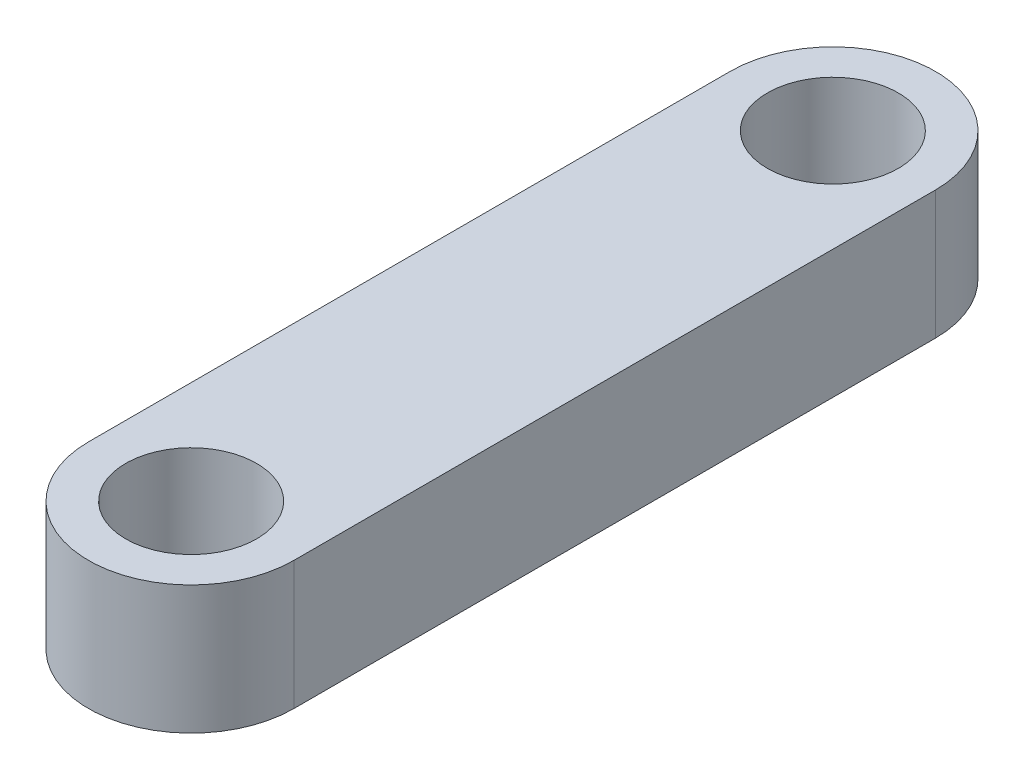
ISO-10303-21;
HEADER;
FILE_DESCRIPTION(('STEP AP214'),'2;1');
FILE_NAME('part.step','',(''),(''),'','','');
FILE_SCHEMA(('AUTOMOTIVE_DESIGN { 1 0 10303 214 1 1 1 1 }'));
ENDSEC;
DATA;
#1=APPLICATION_CONTEXT('core data for automotive mechanical design processes');
#2=APPLICATION_PROTOCOL_DEFINITION('international standard','automotive_design',2000,#1);
#3=PRODUCT_CONTEXT('',#1,'mechanical');
#4=PRODUCT('Part','Part','',(#3));
#5=PRODUCT_RELATED_PRODUCT_CATEGORY('part','',(#4));
#6=PRODUCT_DEFINITION_FORMATION('','',#4);
#7=PRODUCT_DEFINITION_CONTEXT('part definition',#1,'design');
#8=PRODUCT_DEFINITION('design','',#6,#7);
#9=PRODUCT_DEFINITION_SHAPE('','',#8);
#10=(LENGTH_UNIT() NAMED_UNIT(*) SI_UNIT(.MILLI.,.METRE.));
#11=(NAMED_UNIT(*) PLANE_ANGLE_UNIT() SI_UNIT($,.RADIAN.));
#12=(NAMED_UNIT(*) SI_UNIT($,.STERADIAN.) SOLID_ANGLE_UNIT());
#13=UNCERTAINTY_MEASURE_WITH_UNIT(LENGTH_MEASURE(1.E-05),#10,'distance_accuracy_value','');
#14=(GEOMETRIC_REPRESENTATION_CONTEXT(3) GLOBAL_UNCERTAINTY_ASSIGNED_CONTEXT((#13)) GLOBAL_UNIT_ASSIGNED_CONTEXT((#10,
#11,#12)) REPRESENTATION_CONTEXT('',''));
#15=CARTESIAN_POINT('',(0.,0.,0.));
#16=DIRECTION('',(0.,0.,1.));
#17=DIRECTION('',(1.,0.,0.));
#18=AXIS2_PLACEMENT_3D('',#15,#16,#17);
#19=CARTESIAN_POINT('',(0.,5.,-12.5));
#20=DIRECTION('',(0.,-1.,0.));
#21=DIRECTION('',(0.,0.,-1.));
#22=AXIS2_PLACEMENT_3D('',#19,#20,#21);
#23=CYLINDRICAL_SURFACE('',#22,3.99999999999999);
#24=CARTESIAN_POINT('',(0.,0.,-12.5));
#25=DIRECTION('',(0.,1.,0.));
#26=DIRECTION('',(0.,0.,1.));
#27=AXIS2_PLACEMENT_3D('',#24,#25,#26);
#28=CIRCLE('',#27,3.99999999999999);
#29=CARTESIAN_POINT('',(3.99999999999999,0.,-12.5));
#30=VERTEX_POINT('',#29);
#31=CARTESIAN_POINT('',(-3.99999999999999,0.,-12.5));
#32=VERTEX_POINT('',#31);
#33=EDGE_CURVE('E98',#30,#32,#28,.T.);
#34=ORIENTED_EDGE('',*,*,#33,.T.);
#35=DIRECTION('',(0.,-1.,0.));
#36=VECTOR('',#35,1.);
#37=CARTESIAN_POINT('',(-3.99999999999999,5.,-12.5));
#38=LINE('',#37,#36);
#39=CARTESIAN_POINT('',(-3.99999999999999,5.,-12.5));
#40=VERTEX_POINT('',#39);
#41=EDGE_CURVE('E11',#40,#32,#38,.T.);
#42=ORIENTED_EDGE('',*,*,#41,.F.);
#43=CARTESIAN_POINT('',(0.,5.,-12.5));
#44=DIRECTION('',(0.,1.,0.));
#45=DIRECTION('',(0.,0.,1.));
#46=AXIS2_PLACEMENT_3D('',#43,#44,#45);
#47=CIRCLE('',#46,3.99999999999999);
#48=CARTESIAN_POINT('',(3.99999999999999,5.,-12.5));
#49=VERTEX_POINT('',#48);
#50=EDGE_CURVE('E86',#49,#40,#47,.T.);
#51=ORIENTED_EDGE('',*,*,#50,.F.);
#52=DIRECTION('',(0.,-1.,0.));
#53=VECTOR('',#52,1.);
#54=CARTESIAN_POINT('',(3.99999999999999,5.,-12.5));
#55=LINE('',#54,#53);
#56=EDGE_CURVE('E94',#49,#30,#55,.T.);
#57=ORIENTED_EDGE('',*,*,#56,.T.);
#58=EDGE_LOOP('',(#34,#42,#51,#57));
#59=FACE_BOUND('',#58,.T.);
#60=ADVANCED_FACE('F35',(#59),#23,.T.);
#61=CARTESIAN_POINT('',(-3.99999999999999,5.,12.5));
#62=DIRECTION('',(1.,0.,0.));
#63=DIRECTION('',(0.,0.,-1.));
#64=AXIS2_PLACEMENT_3D('',#61,#62,#63);
#65=PLANE('',#64);
#66=DIRECTION('',(0.,0.,1.));
#67=VECTOR('',#66,1.);
#68=CARTESIAN_POINT('',(-3.99999999999999,0.,12.5));
#69=LINE('',#68,#67);
#70=CARTESIAN_POINT('',(-3.99999999999999,0.,12.5));
#71=VERTEX_POINT('',#70);
#72=EDGE_CURVE('E90',#32,#71,#69,.T.);
#73=ORIENTED_EDGE('',*,*,#72,.T.);
#74=DIRECTION('',(0.,-1.,0.));
#75=VECTOR('',#74,1.);
#76=CARTESIAN_POINT('',(-3.99999999999999,5.,12.5));
#77=LINE('',#76,#75);
#78=CARTESIAN_POINT('',(-3.99999999999999,5.,12.5));
#79=VERTEX_POINT('',#78);
#80=EDGE_CURVE('E43',#79,#71,#77,.T.);
#81=ORIENTED_EDGE('',*,*,#80,.F.);
#82=DIRECTION('',(0.,0.,1.));
#83=VECTOR('',#82,1.);
#84=CARTESIAN_POINT('',(-3.99999999999999,5.,12.5));
#85=LINE('',#84,#83);
#86=EDGE_CURVE('E81',#40,#79,#85,.T.);
#87=ORIENTED_EDGE('',*,*,#86,.F.);
#88=ORIENTED_EDGE('',*,*,#41,.T.);
#89=EDGE_LOOP('',(#73,#81,#87,#88));
#90=FACE_BOUND('',#89,.T.);
#91=ADVANCED_FACE('F89',(#90),#65,.F.);
#92=CARTESIAN_POINT('',(0.,5.,12.5));
#93=DIRECTION('',(0.,-1.,0.));
#94=DIRECTION('',(0.,0.,-1.));
#95=AXIS2_PLACEMENT_3D('',#92,#93,#94);
#96=CYLINDRICAL_SURFACE('',#95,3.99999999999999);
#97=CARTESIAN_POINT('',(0.,0.,12.5));
#98=DIRECTION('',(0.,1.,0.));
#99=DIRECTION('',(0.,0.,1.));
#100=AXIS2_PLACEMENT_3D('',#97,#98,#99);
#101=CIRCLE('',#100,3.99999999999999);
#102=CARTESIAN_POINT('',(3.99999999999999,0.,12.5));
#103=VERTEX_POINT('',#102);
#104=EDGE_CURVE('E68',#71,#103,#101,.T.);
#105=ORIENTED_EDGE('',*,*,#104,.T.);
#106=DIRECTION('',(0.,-1.,0.));
#107=VECTOR('',#106,1.);
#108=CARTESIAN_POINT('',(3.99999999999999,5.,12.5));
#109=LINE('',#108,#107);
#110=CARTESIAN_POINT('',(3.99999999999999,5.,12.5));
#111=VERTEX_POINT('',#110);
#112=EDGE_CURVE('E91',#111,#103,#109,.T.);
#113=ORIENTED_EDGE('',*,*,#112,.F.);
#114=CARTESIAN_POINT('',(0.,5.,12.5));
#115=DIRECTION('',(0.,1.,0.));
#116=DIRECTION('',(0.,0.,1.));
#117=AXIS2_PLACEMENT_3D('',#114,#115,#116);
#118=CIRCLE('',#117,3.99999999999999);
#119=EDGE_CURVE('E84',#79,#111,#118,.T.);
#120=ORIENTED_EDGE('',*,*,#119,.F.);
#121=ORIENTED_EDGE('',*,*,#80,.T.);
#122=EDGE_LOOP('',(#105,#113,#120,#121));
#123=FACE_BOUND('',#122,.T.);
#124=ADVANCED_FACE('F92',(#123),#96,.T.);
#125=CARTESIAN_POINT('',(3.99999999999999,5.,12.5));
#126=DIRECTION('',(-1.,0.,0.));
#127=DIRECTION('',(0.,0.,1.));
#128=AXIS2_PLACEMENT_3D('',#125,#126,#127);
#129=PLANE('',#128);
#130=DIRECTION('',(0.,0.,-1.));
#131=VECTOR('',#130,1.);
#132=CARTESIAN_POINT('',(3.99999999999999,0.,12.5));
#133=LINE('',#132,#131);
#134=EDGE_CURVE('E74',#103,#30,#133,.T.);
#135=ORIENTED_EDGE('',*,*,#134,.T.);
#136=ORIENTED_EDGE('',*,*,#56,.F.);
#137=DIRECTION('',(0.,0.,-1.));
#138=VECTOR('',#137,1.);
#139=CARTESIAN_POINT('',(3.99999999999999,5.,12.5));
#140=LINE('',#139,#138);
#141=EDGE_CURVE('E51',#111,#49,#140,.T.);
#142=ORIENTED_EDGE('',*,*,#141,.F.);
#143=ORIENTED_EDGE('',*,*,#112,.T.);
#144=EDGE_LOOP('',(#135,#136,#142,#143));
#145=FACE_BOUND('',#144,.T.);
#146=ADVANCED_FACE('F106',(#145),#129,.F.);
#147=CARTESIAN_POINT('',(0.,5.,-12.5));
#148=DIRECTION('',(0.,1.,0.));
#149=DIRECTION('',(0.,0.,1.));
#150=AXIS2_PLACEMENT_3D('',#147,#148,#149);
#151=PLANE('',#150);
#152=CARTESIAN_POINT('',(0.,5.,-12.5));
#153=DIRECTION('',(0.,1.,0.));
#154=DIRECTION('',(0.,0.,1.));
#155=AXIS2_PLACEMENT_3D('',#152,#153,#154);
#156=CIRCLE('',#155,2.55);
#157=CARTESIAN_POINT('',(0.,5.,-9.95));
#158=VERTEX_POINT('',#157);
#159=EDGE_CURVE('E118',#158,#158,#156,.T.);
#160=ORIENTED_EDGE('',*,*,#159,.F.);
#161=EDGE_LOOP('',(#160));
#162=FACE_BOUND('',#161,.T.);
#163=CARTESIAN_POINT('',(0.,5.,12.5));
#164=DIRECTION('',(0.,1.,0.));
#165=DIRECTION('',(0.,0.,1.));
#166=AXIS2_PLACEMENT_3D('',#163,#164,#165);
#167=CIRCLE('',#166,2.55);
#168=CARTESIAN_POINT('',(0.,5.,15.05));
#169=VERTEX_POINT('',#168);
#170=EDGE_CURVE('E112',#169,#169,#167,.T.);
#171=ORIENTED_EDGE('',*,*,#170,.F.);
#172=EDGE_LOOP('',(#171));
#173=FACE_BOUND('',#172,.T.);
#174=ORIENTED_EDGE('',*,*,#50,.T.);
#175=ORIENTED_EDGE('',*,*,#86,.T.);
#176=ORIENTED_EDGE('',*,*,#119,.T.);
#177=ORIENTED_EDGE('',*,*,#141,.T.);
#178=EDGE_LOOP('',(#174,#175,#176,#177));
#179=FACE_BOUND('',#178,.T.);
#180=ADVANCED_FACE('F82',(#162,#173,#179),#151,.T.);
#181=CARTESIAN_POINT('',(0.,0.,-12.5));
#182=DIRECTION('',(0.,1.,0.));
#183=DIRECTION('',(0.,0.,1.));
#184=AXIS2_PLACEMENT_3D('',#181,#182,#183);
#185=PLANE('',#184);
#186=CARTESIAN_POINT('',(0.,0.,-12.5));
#187=DIRECTION('',(0.,1.,0.));
#188=DIRECTION('',(0.,0.,1.));
#189=AXIS2_PLACEMENT_3D('',#186,#187,#188);
#190=CIRCLE('',#189,2.55);
#191=CARTESIAN_POINT('',(0.,0.,-9.95));
#192=VERTEX_POINT('',#191);
#193=EDGE_CURVE('E101',#192,#192,#190,.T.);
#194=ORIENTED_EDGE('',*,*,#193,.T.);
#195=EDGE_LOOP('',(#194));
#196=FACE_BOUND('',#195,.T.);
#197=CARTESIAN_POINT('',(0.,0.,12.5));
#198=DIRECTION('',(0.,1.,0.));
#199=DIRECTION('',(0.,0.,1.));
#200=AXIS2_PLACEMENT_3D('',#197,#198,#199);
#201=CIRCLE('',#200,2.55);
#202=CARTESIAN_POINT('',(0.,0.,15.05));
#203=VERTEX_POINT('',#202);
#204=EDGE_CURVE('E115',#203,#203,#201,.T.);
#205=ORIENTED_EDGE('',*,*,#204,.T.);
#206=EDGE_LOOP('',(#205));
#207=FACE_BOUND('',#206,.T.);
#208=ORIENTED_EDGE('',*,*,#33,.F.);
#209=ORIENTED_EDGE('',*,*,#134,.F.);
#210=ORIENTED_EDGE('',*,*,#104,.F.);
#211=ORIENTED_EDGE('',*,*,#72,.F.);
#212=EDGE_LOOP('',(#208,#209,#210,#211));
#213=FACE_BOUND('',#212,.T.);
#214=ADVANCED_FACE('F109',(#196,#207,#213),#185,.F.);
#215=CARTESIAN_POINT('',(0.,0.,12.5));
#216=DIRECTION('',(0.,1.,0.));
#217=DIRECTION('',(0.,0.,1.));
#218=AXIS2_PLACEMENT_3D('',#215,#216,#217);
#219=CYLINDRICAL_SURFACE('',#218,2.55);
#220=ORIENTED_EDGE('',*,*,#204,.F.);
#221=EDGE_LOOP('',(#220));
#222=FACE_BOUND('',#221,.T.);
#223=ORIENTED_EDGE('',*,*,#170,.T.);
#224=EDGE_LOOP('',(#223));
#225=FACE_BOUND('',#224,.T.);
#226=ADVANCED_FACE('F129',(#222,#225),#219,.F.);
#227=CARTESIAN_POINT('',(0.,0.,-12.5));
#228=DIRECTION('',(0.,1.,0.));
#229=DIRECTION('',(0.,0.,1.));
#230=AXIS2_PLACEMENT_3D('',#227,#228,#229);
#231=CYLINDRICAL_SURFACE('',#230,2.55);
#232=ORIENTED_EDGE('',*,*,#193,.F.);
#233=EDGE_LOOP('',(#232));
#234=FACE_BOUND('',#233,.T.);
#235=ORIENTED_EDGE('',*,*,#159,.T.);
#236=EDGE_LOOP('',(#235));
#237=FACE_BOUND('',#236,.T.);
#238=ADVANCED_FACE('F126',(#234,#237),#231,.F.);
#239=CLOSED_SHELL('',(#60,#91,#124,#146,#180,#214,#226,#238));
#240=MANIFOLD_SOLID_BREP('B2',#239);
#241=ADVANCED_BREP_SHAPE_REPRESENTATION('',(#18,#240),#14);
#242=SHAPE_DEFINITION_REPRESENTATION(#9,#241);
ENDSEC;
END-ISO-10303-21;
